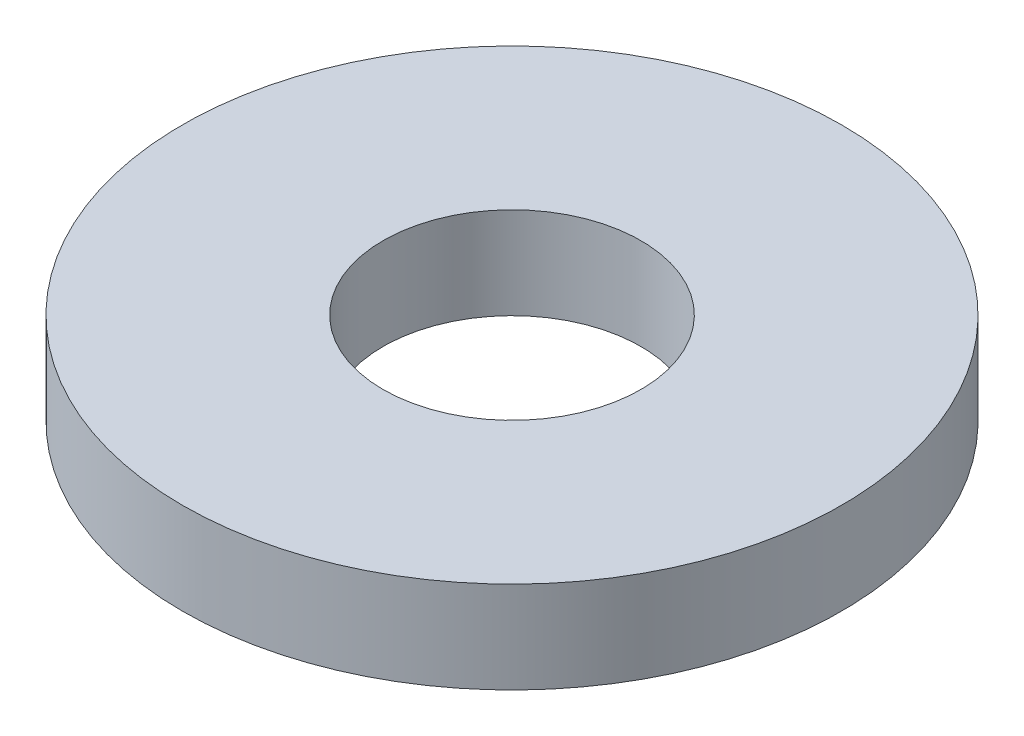
ISO-10303-21;
HEADER;
FILE_DESCRIPTION(('STEP AP214'),'2;1');
FILE_NAME('part.step','',(''),(''),'','','');
FILE_SCHEMA(('AUTOMOTIVE_DESIGN { 1 0 10303 214 1 1 1 1 }'));
ENDSEC;
DATA;
#1=APPLICATION_CONTEXT('core data for automotive mechanical design processes');
#2=APPLICATION_PROTOCOL_DEFINITION('international standard','automotive_design',2000,#1);
#3=PRODUCT_CONTEXT('',#1,'mechanical');
#4=PRODUCT('Part','Part','',(#3));
#5=PRODUCT_RELATED_PRODUCT_CATEGORY('part','',(#4));
#6=PRODUCT_DEFINITION_FORMATION('','',#4);
#7=PRODUCT_DEFINITION_CONTEXT('part definition',#1,'design');
#8=PRODUCT_DEFINITION('design','',#6,#7);
#9=PRODUCT_DEFINITION_SHAPE('','',#8);
#10=(LENGTH_UNIT() NAMED_UNIT(*) SI_UNIT(.MILLI.,.METRE.));
#11=(NAMED_UNIT(*) PLANE_ANGLE_UNIT() SI_UNIT($,.RADIAN.));
#12=(NAMED_UNIT(*) SI_UNIT($,.STERADIAN.) SOLID_ANGLE_UNIT());
#13=UNCERTAINTY_MEASURE_WITH_UNIT(LENGTH_MEASURE(1.E-05),#10,'distance_accuracy_value','');
#14=(GEOMETRIC_REPRESENTATION_CONTEXT(3) GLOBAL_UNCERTAINTY_ASSIGNED_CONTEXT((#13)) GLOBAL_UNIT_ASSIGNED_CONTEXT((#10,
#11,#12)) REPRESENTATION_CONTEXT('',''));
#15=CARTESIAN_POINT('',(0.,0.,0.));
#16=DIRECTION('',(0.,0.,1.));
#17=DIRECTION('',(1.,0.,0.));
#18=AXIS2_PLACEMENT_3D('',#15,#16,#17);
#19=CARTESIAN_POINT('',(0.,16.,0.));
#20=DIRECTION('',(0.,-1.,0.));
#21=DIRECTION('',(0.,0.,-1.));
#22=AXIS2_PLACEMENT_3D('',#19,#20,#21);
#23=CYLINDRICAL_SURFACE('',#22,57.5);
#24=CARTESIAN_POINT('',(0.,16.,0.));
#25=DIRECTION('',(0.,1.,0.));
#26=DIRECTION('',(0.,0.,1.));
#27=AXIS2_PLACEMENT_3D('',#24,#25,#26);
#28=CIRCLE('',#27,57.5);
#29=CARTESIAN_POINT('',(0.,16.,57.5));
#30=VERTEX_POINT('',#29);
#31=EDGE_CURVE('E10',#30,#30,#28,.T.);
#32=ORIENTED_EDGE('',*,*,#31,.F.);
#33=EDGE_LOOP('',(#32));
#34=FACE_BOUND('',#33,.T.);
#35=CARTESIAN_POINT('',(0.,0.,0.));
#36=DIRECTION('',(0.,1.,0.));
#37=DIRECTION('',(0.,0.,1.));
#38=AXIS2_PLACEMENT_3D('',#35,#36,#37);
#39=CIRCLE('',#38,57.5);
#40=CARTESIAN_POINT('',(0.,0.,57.5));
#41=VERTEX_POINT('',#40);
#42=EDGE_CURVE('E37',#41,#41,#39,.T.);
#43=ORIENTED_EDGE('',*,*,#42,.T.);
#44=EDGE_LOOP('',(#43));
#45=FACE_BOUND('',#44,.T.);
#46=ADVANCED_FACE('F40',(#34,#45),#23,.T.);
#47=CARTESIAN_POINT('',(0.,16.,0.));
#48=DIRECTION('',(0.,1.,0.));
#49=DIRECTION('',(0.,0.,1.));
#50=AXIS2_PLACEMENT_3D('',#47,#48,#49);
#51=PLANE('',#50);
#52=CARTESIAN_POINT('',(0.,16.,0.));
#53=DIRECTION('',(0.,1.,0.));
#54=DIRECTION('',(0.,0.,1.));
#55=AXIS2_PLACEMENT_3D('',#52,#53,#54);
#56=CIRCLE('',#55,22.5);
#57=CARTESIAN_POINT('',(0.,16.,22.5));
#58=VERTEX_POINT('',#57);
#59=EDGE_CURVE('E50',#58,#58,#56,.T.);
#60=ORIENTED_EDGE('',*,*,#59,.F.);
#61=EDGE_LOOP('',(#60));
#62=FACE_BOUND('',#61,.T.);
#63=ORIENTED_EDGE('',*,*,#31,.T.);
#64=EDGE_LOOP('',(#63));
#65=FACE_BOUND('',#64,.T.);
#66=ADVANCED_FACE('F59',(#62,#65),#51,.T.);
#67=CARTESIAN_POINT('',(0.,0.,0.));
#68=DIRECTION('',(0.,1.,0.));
#69=DIRECTION('',(0.,0.,1.));
#70=AXIS2_PLACEMENT_3D('',#67,#68,#69);
#71=PLANE('',#70);
#72=CARTESIAN_POINT('',(0.,0.,0.));
#73=DIRECTION('',(0.,1.,0.));
#74=DIRECTION('',(0.,0.,1.));
#75=AXIS2_PLACEMENT_3D('',#72,#73,#74);
#76=CIRCLE('',#75,22.5);
#77=CARTESIAN_POINT('',(0.,0.,22.5));
#78=VERTEX_POINT('',#77);
#79=EDGE_CURVE('E47',#78,#78,#76,.T.);
#80=ORIENTED_EDGE('',*,*,#79,.T.);
#81=EDGE_LOOP('',(#80));
#82=FACE_BOUND('',#81,.T.);
#83=ORIENTED_EDGE('',*,*,#42,.F.);
#84=EDGE_LOOP('',(#83));
#85=FACE_BOUND('',#84,.T.);
#86=ADVANCED_FACE('F58',(#82,#85),#71,.F.);
#87=CARTESIAN_POINT('',(0.,16.,0.));
#88=DIRECTION('',(0.,-1.,0.));
#89=DIRECTION('',(0.,0.,-1.));
#90=AXIS2_PLACEMENT_3D('',#87,#88,#89);
#91=CYLINDRICAL_SURFACE('',#90,22.5);
#92=ORIENTED_EDGE('',*,*,#59,.T.);
#93=EDGE_LOOP('',(#92));
#94=FACE_BOUND('',#93,.T.);
#95=ORIENTED_EDGE('',*,*,#79,.F.);
#96=EDGE_LOOP('',(#95));
#97=FACE_BOUND('',#96,.T.);
#98=ADVANCED_FACE('F54',(#94,#97),#91,.F.);
#99=CLOSED_SHELL('',(#46,#66,#86,#98));
#100=MANIFOLD_SOLID_BREP('B2',#99);
#101=ADVANCED_BREP_SHAPE_REPRESENTATION('',(#18,#100),#14);
#102=SHAPE_DEFINITION_REPRESENTATION(#9,#101);
ENDSEC;
END-ISO-10303-21;
